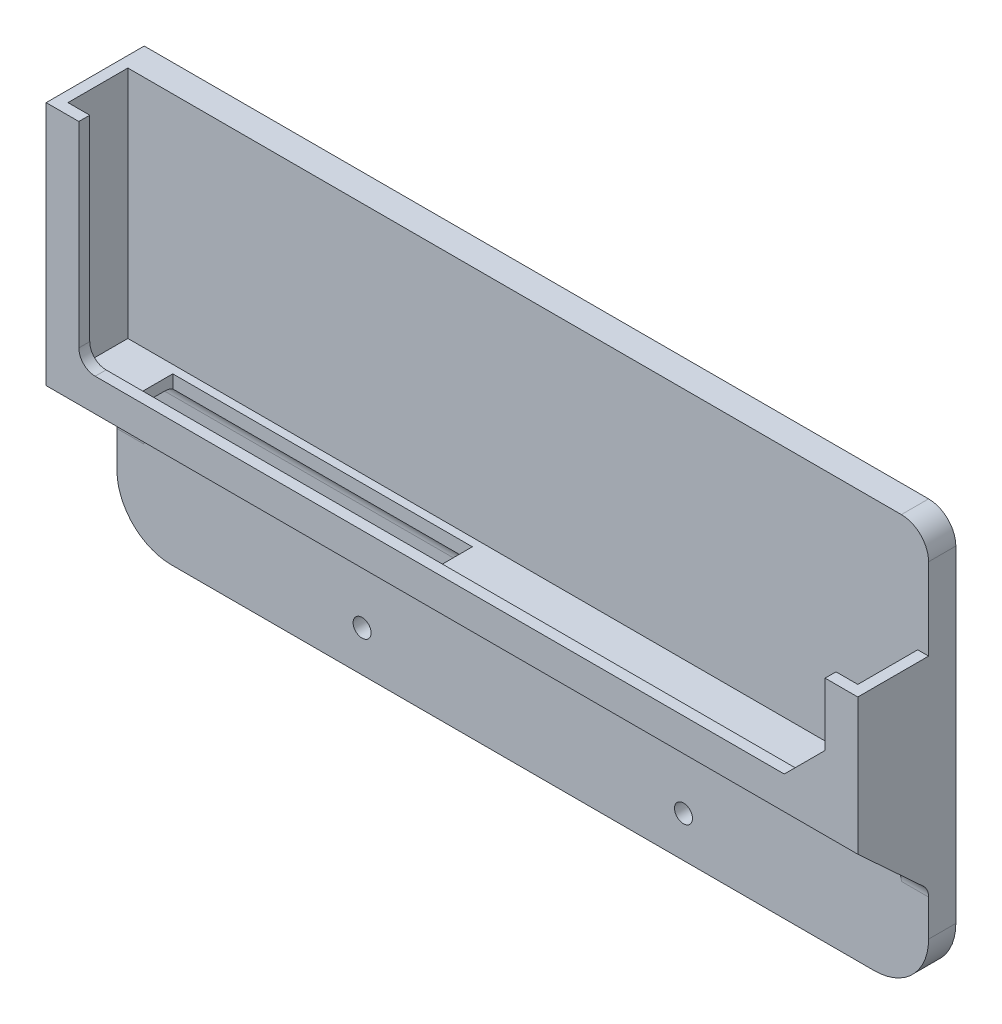
ISO-10303-21;
HEADER;
FILE_DESCRIPTION(('STEP AP214'),'2;1');
FILE_NAME('part.step','',(''),(''),'','','');
FILE_SCHEMA(('AUTOMOTIVE_DESIGN { 1 0 10303 214 1 1 1 1 }'));
ENDSEC;
DATA;
#1=APPLICATION_CONTEXT('core data for automotive mechanical design processes');
#2=APPLICATION_PROTOCOL_DEFINITION('international standard','automotive_design',2000,#1);
#3=PRODUCT_CONTEXT('',#1,'mechanical');
#4=PRODUCT('Part','Part','',(#3));
#5=PRODUCT_RELATED_PRODUCT_CATEGORY('part','',(#4));
#6=PRODUCT_DEFINITION_FORMATION('','',#4);
#7=PRODUCT_DEFINITION_CONTEXT('part definition',#1,'design');
#8=PRODUCT_DEFINITION('design','',#6,#7);
#9=PRODUCT_DEFINITION_SHAPE('','',#8);
#10=(LENGTH_UNIT() NAMED_UNIT(*) SI_UNIT(.MILLI.,.METRE.));
#11=(NAMED_UNIT(*) PLANE_ANGLE_UNIT() SI_UNIT($,.RADIAN.));
#12=(NAMED_UNIT(*) SI_UNIT($,.STERADIAN.) SOLID_ANGLE_UNIT());
#13=UNCERTAINTY_MEASURE_WITH_UNIT(LENGTH_MEASURE(1.E-05),#10,'distance_accuracy_value','');
#14=(GEOMETRIC_REPRESENTATION_CONTEXT(3) GLOBAL_UNCERTAINTY_ASSIGNED_CONTEXT((#13)) GLOBAL_UNIT_ASSIGNED_CONTEXT((#10,
#11,#12)) REPRESENTATION_CONTEXT('',''));
#15=CARTESIAN_POINT('',(0.,0.,0.));
#16=DIRECTION('',(0.,0.,1.));
#17=DIRECTION('',(1.,0.,0.));
#18=AXIS2_PLACEMENT_3D('',#15,#16,#17);
#19=CARTESIAN_POINT('',(0.,30.,16.));
#20=DIRECTION('',(0.,1.,0.));
#21=DIRECTION('',(0.,0.,1.));
#22=AXIS2_PLACEMENT_3D('',#19,#20,#21);
#23=PLANE('',#22);
#24=DIRECTION('',(0.,0.,-1.));
#25=VECTOR('',#24,1.);
#26=CARTESIAN_POINT('',(11.7410881152894,30.,16.));
#27=LINE('',#26,#25);
#28=CARTESIAN_POINT('',(11.7410881152894,30.,14.5));
#29=VERTEX_POINT('',#28);
#30=CARTESIAN_POINT('',(11.7410881152894,30.,8.));
#31=VERTEX_POINT('',#30);
#32=EDGE_CURVE('E291',#29,#31,#27,.T.);
#33=ORIENTED_EDGE('',*,*,#32,.F.);
#34=DIRECTION('',(1.,0.,0.));
#35=VECTOR('',#34,1.);
#36=CARTESIAN_POINT('',(0.,30.,14.5));
#37=LINE('',#36,#35);
#38=CARTESIAN_POINT('',(66.7410881152894,30.,14.5));
#39=VERTEX_POINT('',#38);
#40=EDGE_CURVE('E294',#29,#39,#37,.T.);
#41=ORIENTED_EDGE('',*,*,#40,.T.);
#42=DIRECTION('',(0.,0.,-1.));
#43=VECTOR('',#42,1.);
#44=CARTESIAN_POINT('',(66.7410881152894,30.,16.));
#45=LINE('',#44,#43);
#46=CARTESIAN_POINT('',(66.7410881152894,30.,8.));
#47=VERTEX_POINT('',#46);
#48=EDGE_CURVE('E283',#39,#47,#45,.T.);
#49=ORIENTED_EDGE('',*,*,#48,.T.);
#50=DIRECTION('',(1.,0.,0.));
#51=VECTOR('',#50,1.);
#52=CARTESIAN_POINT('',(0.,30.,8.));
#53=LINE('',#52,#51);
#54=CARTESIAN_POINT('',(144.,30.,8.));
#55=VERTEX_POINT('',#54);
#56=EDGE_CURVE('E526',#47,#55,#53,.T.);
#57=ORIENTED_EDGE('',*,*,#56,.T.);
#58=DIRECTION('',(0.,0.,-1.));
#59=VECTOR('',#58,1.);
#60=CARTESIAN_POINT('',(144.,30.,18.));
#61=LINE('',#60,#59);
#62=CARTESIAN_POINT('',(144.,30.,18.));
#63=VERTEX_POINT('',#62);
#64=EDGE_CURVE('E299',#63,#55,#61,.T.);
#65=ORIENTED_EDGE('',*,*,#64,.F.);
#66=DIRECTION('',(1.,0.,0.));
#67=VECTOR('',#66,1.);
#68=CARTESIAN_POINT('',(0.,30.,18.));
#69=LINE('',#68,#67);
#70=CARTESIAN_POINT('',(5.,30.,18.));
#71=VERTEX_POINT('',#70);
#72=EDGE_CURVE('E342',#71,#63,#69,.T.);
#73=ORIENTED_EDGE('',*,*,#72,.F.);
#74=DIRECTION('',(0.,0.,-1.));
#75=VECTOR('',#74,1.);
#76=CARTESIAN_POINT('',(5.,30.,18.));
#77=LINE('',#76,#75);
#78=CARTESIAN_POINT('',(5.,30.,8.));
#79=VERTEX_POINT('',#78);
#80=EDGE_CURVE('E318',#71,#79,#77,.T.);
#81=ORIENTED_EDGE('',*,*,#80,.T.);
#82=EDGE_CURVE('E527',#79,#31,#53,.T.);
#83=ORIENTED_EDGE('',*,*,#82,.T.);
#84=EDGE_LOOP('',(#33,#41,#49,#57,#65,#73,#81,#83));
#85=FACE_BOUND('',#84,.T.);
#86=ADVANCED_FACE('F41',(#85),#23,.F.);
#87=CARTESIAN_POINT('',(0.,27.,8.));
#88=DIRECTION('',(1.,0.,0.));
#89=DIRECTION('',(0.,0.,-1.));
#90=AXIS2_PLACEMENT_3D('',#87,#88,#89);
#91=CYLINDRICAL_SURFACE('',#90,3.);
#92=CARTESIAN_POINT('',(11.7410881152894,27.,8.));
#93=DIRECTION('',(1.,0.,0.));
#94=DIRECTION('',(0.,0.,-1.));
#95=AXIS2_PLACEMENT_3D('',#92,#93,#94);
#96=CIRCLE('',#95,3.);
#97=CARTESIAN_POINT('',(11.7410881152894,29.5980762113533,6.5));
#98=VERTEX_POINT('',#97);
#99=EDGE_CURVE('E573',#31,#98,#96,.F.);
#100=ORIENTED_EDGE('',*,*,#99,.F.);
#101=ORIENTED_EDGE('',*,*,#82,.F.);
#102=CARTESIAN_POINT('',(5.,27.,8.));
#103=DIRECTION('',(-1.,0.,0.));
#104=DIRECTION('',(0.,0.,1.));
#105=AXIS2_PLACEMENT_3D('',#102,#103,#104);
#106=CIRCLE('',#105,3.);
#107=CARTESIAN_POINT('',(5.,27.,5.));
#108=VERTEX_POINT('',#107);
#109=EDGE_CURVE('E545',#108,#79,#106,.F.);
#110=ORIENTED_EDGE('',*,*,#109,.F.);
#111=DIRECTION('',(1.,0.,0.));
#112=VECTOR('',#111,1.);
#113=CARTESIAN_POINT('',(0.,27.,5.));
#114=LINE('',#113,#112);
#115=CARTESIAN_POINT('',(144.,27.,5.));
#116=VERTEX_POINT('',#115);
#117=EDGE_CURVE('E542',#116,#108,#114,.F.);
#118=ORIENTED_EDGE('',*,*,#117,.F.);
#119=CARTESIAN_POINT('',(144.,27.,8.));
#120=DIRECTION('',(1.,0.,0.));
#121=DIRECTION('',(0.,0.,-1.));
#122=AXIS2_PLACEMENT_3D('',#119,#120,#121);
#123=CIRCLE('',#122,3.);
#124=EDGE_CURVE('E531',#55,#116,#123,.F.);
#125=ORIENTED_EDGE('',*,*,#124,.F.);
#126=ORIENTED_EDGE('',*,*,#56,.F.);
#127=CARTESIAN_POINT('',(66.7410881152894,27.,8.));
#128=DIRECTION('',(1.,0.,0.));
#129=DIRECTION('',(0.,0.,-1.));
#130=AXIS2_PLACEMENT_3D('',#127,#128,#129);
#131=CIRCLE('',#130,3.);
#132=CARTESIAN_POINT('',(66.7410881152894,29.5980762113533,6.5));
#133=VERTEX_POINT('',#132);
#134=EDGE_CURVE('E568',#47,#133,#131,.F.);
#135=ORIENTED_EDGE('',*,*,#134,.T.);
#136=DIRECTION('',(1.,0.,0.));
#137=VECTOR('',#136,1.);
#138=CARTESIAN_POINT('',(0.,29.5980762113533,6.5));
#139=LINE('',#138,#137);
#140=EDGE_CURVE('E253',#98,#133,#139,.T.);
#141=ORIENTED_EDGE('',*,*,#140,.F.);
#142=EDGE_LOOP('',(#100,#101,#110,#118,#125,#126,#135,#141));
#143=FACE_BOUND('',#142,.T.);
#144=ADVANCED_FACE('F704',(#143),#91,.F.);
#145=CARTESIAN_POINT('',(0.,0.,5.));
#146=DIRECTION('',(0.,0.,1.));
#147=DIRECTION('',(1.,0.,0.));
#148=AXIS2_PLACEMENT_3D('',#145,#146,#147);
#149=PLANE('',#148);
#150=DIRECTION('',(0.,-1.,0.));
#151=VECTOR('',#150,1.);
#152=CARTESIAN_POINT('',(144.,30.,5.));
#153=LINE('',#152,#151);
#154=CARTESIAN_POINT('',(144.,16.6865063047027,5.));
#155=VERTEX_POINT('',#154);
#156=EDGE_CURVE('E307',#116,#155,#153,.T.);
#157=ORIENTED_EDGE('',*,*,#156,.F.);
#158=ORIENTED_EDGE('',*,*,#117,.T.);
#159=DIRECTION('',(0.,-1.,0.));
#160=VECTOR('',#159,1.);
#161=CARTESIAN_POINT('',(5.,30.,5.));
#162=LINE('',#161,#160);
#163=CARTESIAN_POINT('',(5.,16.6865063047027,5.));
#164=VERTEX_POINT('',#163);
#165=EDGE_CURVE('E322',#108,#164,#162,.T.);
#166=ORIENTED_EDGE('',*,*,#165,.T.);
#167=DIRECTION('',(-1.,0.,0.));
#168=VECTOR('',#167,1.);
#169=CARTESIAN_POINT('',(0.,16.6865063047027,5.));
#170=LINE('',#169,#168);
#171=CARTESIAN_POINT('',(0.,16.6865063047027,5.));
#172=VERTEX_POINT('',#171);
#173=EDGE_CURVE('E534',#164,#172,#170,.T.);
#174=ORIENTED_EDGE('',*,*,#173,.T.);
#175=DIRECTION('',(0.,1.,0.));
#176=VECTOR('',#175,1.);
#177=CARTESIAN_POINT('',(0.,0.,5.));
#178=LINE('',#177,#176);
#179=CARTESIAN_POINT('',(0.,10.,5.));
#180=VERTEX_POINT('',#179);
#181=EDGE_CURVE('E437',#180,#172,#178,.T.);
#182=ORIENTED_EDGE('',*,*,#181,.F.);
#183=CARTESIAN_POINT('',(10.,10.,5.));
#184=DIRECTION('',(0.,0.,1.));
#185=DIRECTION('',(1.,0.,0.));
#186=AXIS2_PLACEMENT_3D('',#183,#184,#185);
#187=CIRCLE('',#186,10.);
#188=CARTESIAN_POINT('',(10.,0.,5.));
#189=VERTEX_POINT('',#188);
#190=EDGE_CURVE('E503',#180,#189,#187,.T.);
#191=ORIENTED_EDGE('',*,*,#190,.T.);
#192=DIRECTION('',(1.,0.,0.));
#193=VECTOR('',#192,1.);
#194=CARTESIAN_POINT('',(0.,0.,5.));
#195=LINE('',#194,#193);
#196=CARTESIAN_POINT('',(139.,0.,5.));
#197=VERTEX_POINT('',#196);
#198=EDGE_CURVE('E441',#189,#197,#195,.T.);
#199=ORIENTED_EDGE('',*,*,#198,.T.);
#200=CARTESIAN_POINT('',(139.,10.,5.));
#201=DIRECTION('',(0.,0.,1.));
#202=DIRECTION('',(1.,0.,0.));
#203=AXIS2_PLACEMENT_3D('',#200,#201,#202);
#204=CIRCLE('',#203,10.);
#205=CARTESIAN_POINT('',(149.,10.,5.));
#206=VERTEX_POINT('',#205);
#207=EDGE_CURVE('E506',#197,#206,#204,.T.);
#208=ORIENTED_EDGE('',*,*,#207,.T.);
#209=DIRECTION('',(0.,1.,0.));
#210=VECTOR('',#209,1.);
#211=CARTESIAN_POINT('',(149.,0.,5.));
#212=LINE('',#211,#210);
#213=CARTESIAN_POINT('',(149.,16.6865063047027,5.));
#214=VERTEX_POINT('',#213);
#215=EDGE_CURVE('E447',#206,#214,#212,.T.);
#216=ORIENTED_EDGE('',*,*,#215,.T.);
#217=DIRECTION('',(1.,0.,0.));
#218=VECTOR('',#217,1.);
#219=CARTESIAN_POINT('',(144.,16.6865063047027,5.));
#220=LINE('',#219,#218);
#221=EDGE_CURVE('E538',#214,#155,#220,.F.);
#222=ORIENTED_EDGE('',*,*,#221,.T.);
#223=EDGE_LOOP('',(#157,#158,#166,#174,#182,#191,#199,#208,#216,#222));
#224=FACE_BOUND('',#223,.T.);
#225=CARTESIAN_POINT('',(104.,7.5,5.));
#226=DIRECTION('',(0.,0.,1.));
#227=DIRECTION('',(1.,0.,0.));
#228=AXIS2_PLACEMENT_3D('',#225,#226,#227);
#229=CIRCLE('',#228,1.64999999999999);
#230=CARTESIAN_POINT('',(105.65,7.5,5.));
#231=VERTEX_POINT('',#230);
#232=EDGE_CURVE('E455',#231,#231,#229,.T.);
#233=ORIENTED_EDGE('',*,*,#232,.F.);
#234=EDGE_LOOP('',(#233));
#235=FACE_BOUND('',#234,.T.);
#236=CARTESIAN_POINT('',(45.,7.5,5.));
#237=DIRECTION('',(0.,0.,1.));
#238=DIRECTION('',(1.,0.,0.));
#239=AXIS2_PLACEMENT_3D('',#236,#237,#238);
#240=CIRCLE('',#239,1.65);
#241=CARTESIAN_POINT('',(46.65,7.5,5.));
#242=VERTEX_POINT('',#241);
#243=EDGE_CURVE('E459',#242,#242,#240,.T.);
#244=ORIENTED_EDGE('',*,*,#243,.F.);
#245=EDGE_LOOP('',(#244));
#246=FACE_BOUND('',#245,.T.);
#247=ADVANCED_FACE('F624',(#224,#235,#246),#149,.T.);
#248=CARTESIAN_POINT('',(149.,55.,5.));
#249=VERTEX_POINT('',#248);
#250=CARTESIAN_POINT('',(149.,70.,5.));
#251=VERTEX_POINT('',#250);
#252=EDGE_CURVE('E446',#249,#251,#212,.T.);
#253=ORIENTED_EDGE('',*,*,#252,.T.);
#254=CARTESIAN_POINT('',(144.,70.,5.));
#255=DIRECTION('',(0.,0.,1.));
#256=DIRECTION('',(1.,0.,0.));
#257=AXIS2_PLACEMENT_3D('',#254,#255,#256);
#258=CIRCLE('',#257,5.);
#259=CARTESIAN_POINT('',(144.,75.,5.));
#260=VERTEX_POINT('',#259);
#261=EDGE_CURVE('E11',#251,#260,#258,.T.);
#262=ORIENTED_EDGE('',*,*,#261,.T.);
#263=DIRECTION('',(1.,0.,0.));
#264=VECTOR('',#263,1.);
#265=CARTESIAN_POINT('',(0.,75.,5.));
#266=LINE('',#265,#264);
#267=CARTESIAN_POINT('',(2.,75.,5.));
#268=VERTEX_POINT('',#267);
#269=EDGE_CURVE('E451',#268,#260,#266,.T.);
#270=ORIENTED_EDGE('',*,*,#269,.F.);
#271=DIRECTION('',(0.,1.,0.));
#272=VECTOR('',#271,1.);
#273=CARTESIAN_POINT('',(2.,73.,5.));
#274=LINE('',#273,#272);
#275=CARTESIAN_POINT('',(2.00000000000001,32.,5.));
#276=VERTEX_POINT('',#275);
#277=EDGE_CURVE('E394',#276,#268,#274,.T.);
#278=ORIENTED_EDGE('',*,*,#277,.F.);
#279=DIRECTION('',(-1.,0.,0.));
#280=VECTOR('',#279,1.);
#281=CARTESIAN_POINT('',(2.00000000000001,32.,5.));
#282=LINE('',#281,#280);
#283=CARTESIAN_POINT('',(147.,32.,5.));
#284=VERTEX_POINT('',#283);
#285=EDGE_CURVE('E410',#284,#276,#282,.T.);
#286=ORIENTED_EDGE('',*,*,#285,.F.);
#287=DIRECTION('',(0.,-1.,0.));
#288=VECTOR('',#287,1.);
#289=CARTESIAN_POINT('',(147.,55.,5.));
#290=LINE('',#289,#288);
#291=CARTESIAN_POINT('',(147.,55.,5.));
#292=VERTEX_POINT('',#291);
#293=EDGE_CURVE('E406',#292,#284,#290,.T.);
#294=ORIENTED_EDGE('',*,*,#293,.F.);
#295=DIRECTION('',(-1.,0.,0.));
#296=VECTOR('',#295,1.);
#297=CARTESIAN_POINT('',(149.,55.,5.));
#298=LINE('',#297,#296);
#299=EDGE_CURVE('E388',#249,#292,#298,.T.);
#300=ORIENTED_EDGE('',*,*,#299,.F.);
#301=EDGE_LOOP('',(#253,#262,#270,#278,#286,#294,#300));
#302=FACE_BOUND('',#301,.T.);
#303=ADVANCED_FACE('F655',(#302),#149,.T.);
#304=CARTESIAN_POINT('',(0.,0.,5.));
#305=DIRECTION('',(-1.,0.,0.));
#306=DIRECTION('',(0.,0.,1.));
#307=AXIS2_PLACEMENT_3D('',#304,#305,#306);
#308=PLANE('',#307);
#309=ORIENTED_EDGE('',*,*,#181,.T.);
#310=CARTESIAN_POINT('',(0.,16.6865063047027,8.));
#311=DIRECTION('',(-1.,0.,0.));
#312=DIRECTION('',(0.,0.,1.));
#313=AXIS2_PLACEMENT_3D('',#310,#311,#312);
#314=CIRCLE('',#313,3.);
#315=CARTESIAN_POINT('',(0.,18.8909166385851,5.96515969180078));
#316=VERTEX_POINT('',#315);
#317=EDGE_CURVE('E561',#172,#316,#314,.F.);
#318=ORIENTED_EDGE('',*,*,#317,.T.);
#319=DIRECTION('',(0.,-0.678280102733072,-0.734803444627482));
#320=VECTOR('',#319,1.);
#321=CARTESIAN_POINT('',(0.,30.,18.));
#322=LINE('',#321,#320);
#323=CARTESIAN_POINT('',(0.,30.,18.));
#324=VERTEX_POINT('',#323);
#325=EDGE_CURVE('E317',#324,#316,#322,.T.);
#326=ORIENTED_EDGE('',*,*,#325,.F.);
#327=DIRECTION('',(0.,-1.,0.));
#328=VECTOR('',#327,1.);
#329=CARTESIAN_POINT('',(0.,75.,18.));
#330=LINE('',#329,#328);
#331=CARTESIAN_POINT('',(0.,75.,18.));
#332=VERTEX_POINT('',#331);
#333=EDGE_CURVE('E337',#332,#324,#330,.T.);
#334=ORIENTED_EDGE('',*,*,#333,.F.);
#335=DIRECTION('',(0.,0.,-1.));
#336=VECTOR('',#335,1.);
#337=CARTESIAN_POINT('',(0.,75.,5.));
#338=LINE('',#337,#336);
#339=CARTESIAN_POINT('',(0.,75.,0.));
#340=VERTEX_POINT('',#339);
#341=EDGE_CURVE('E463',#332,#340,#338,.T.);
#342=ORIENTED_EDGE('',*,*,#341,.T.);
#343=DIRECTION('',(0.,1.,0.));
#344=VECTOR('',#343,1.);
#345=CARTESIAN_POINT('',(0.,0.,0.));
#346=LINE('',#345,#344);
#347=CARTESIAN_POINT('',(0.,10.,0.));
#348=VERTEX_POINT('',#347);
#349=EDGE_CURVE('E436',#348,#340,#346,.T.);
#350=ORIENTED_EDGE('',*,*,#349,.F.);
#351=DIRECTION('',(0.,0.,-1.));
#352=VECTOR('',#351,1.);
#353=CARTESIAN_POINT('',(0.,10.,5.));
#354=LINE('',#353,#352);
#355=EDGE_CURVE('E509',#348,#180,#354,.F.);
#356=ORIENTED_EDGE('',*,*,#355,.T.);
#357=EDGE_LOOP('',(#309,#318,#326,#334,#342,#350,#356));
#358=FACE_BOUND('',#357,.T.);
#359=ADVANCED_FACE('F643',(#358),#308,.T.);
#360=CARTESIAN_POINT('',(0.,0.,5.));
#361=DIRECTION('',(0.,1.,0.));
#362=DIRECTION('',(0.,0.,1.));
#363=AXIS2_PLACEMENT_3D('',#360,#361,#362);
#364=PLANE('',#363);
#365=DIRECTION('',(1.,0.,0.));
#366=VECTOR('',#365,1.);
#367=CARTESIAN_POINT('',(0.,0.,0.));
#368=LINE('',#367,#366);
#369=CARTESIAN_POINT('',(10.,0.,0.));
#370=VERTEX_POINT('',#369);
#371=CARTESIAN_POINT('',(139.,0.,0.));
#372=VERTEX_POINT('',#371);
#373=EDGE_CURVE('E466',#370,#372,#368,.T.);
#374=ORIENTED_EDGE('',*,*,#373,.T.);
#375=DIRECTION('',(0.,0.,-1.));
#376=VECTOR('',#375,1.);
#377=CARTESIAN_POINT('',(139.,0.,5.));
#378=LINE('',#377,#376);
#379=EDGE_CURVE('E500',#372,#197,#378,.F.);
#380=ORIENTED_EDGE('',*,*,#379,.T.);
#381=ORIENTED_EDGE('',*,*,#198,.F.);
#382=DIRECTION('',(0.,0.,-1.));
#383=VECTOR('',#382,1.);
#384=CARTESIAN_POINT('',(10.,0.,0.));
#385=LINE('',#384,#383);
#386=EDGE_CURVE('E496',#189,#370,#385,.T.);
#387=ORIENTED_EDGE('',*,*,#386,.T.);
#388=EDGE_LOOP('',(#374,#380,#381,#387));
#389=FACE_BOUND('',#388,.T.);
#390=ADVANCED_FACE('F635',(#389),#364,.F.);
#391=CARTESIAN_POINT('',(149.,0.,5.));
#392=DIRECTION('',(-1.,0.,0.));
#393=DIRECTION('',(0.,0.,1.));
#394=AXIS2_PLACEMENT_3D('',#391,#392,#393);
#395=PLANE('',#394);
#396=DIRECTION('',(0.,1.,0.));
#397=VECTOR('',#396,1.);
#398=CARTESIAN_POINT('',(149.,0.,0.));
#399=LINE('',#398,#397);
#400=CARTESIAN_POINT('',(149.,10.,0.));
#401=VERTEX_POINT('',#400);
#402=CARTESIAN_POINT('',(149.,70.,0.));
#403=VERTEX_POINT('',#402);
#404=EDGE_CURVE('E470',#401,#403,#399,.T.);
#405=ORIENTED_EDGE('',*,*,#404,.T.);
#406=DIRECTION('',(0.,0.,-1.));
#407=VECTOR('',#406,1.);
#408=CARTESIAN_POINT('',(149.,70.,5.));
#409=LINE('',#408,#407);
#410=EDGE_CURVE('E50',#403,#251,#409,.F.);
#411=ORIENTED_EDGE('',*,*,#410,.T.);
#412=ORIENTED_EDGE('',*,*,#252,.F.);
#413=DIRECTION('',(0.,0.,-1.));
#414=VECTOR('',#413,1.);
#415=CARTESIAN_POINT('',(149.,55.,16.));
#416=LINE('',#415,#414);
#417=CARTESIAN_POINT('',(149.,55.,18.));
#418=VERTEX_POINT('',#417);
#419=EDGE_CURVE('E432',#418,#249,#416,.T.);
#420=ORIENTED_EDGE('',*,*,#419,.F.);
#421=DIRECTION('',(0.,1.,0.));
#422=VECTOR('',#421,1.);
#423=CARTESIAN_POINT('',(149.,30.,18.));
#424=LINE('',#423,#422);
#425=CARTESIAN_POINT('',(149.,30.,18.));
#426=VERTEX_POINT('',#425);
#427=EDGE_CURVE('E347',#426,#418,#424,.T.);
#428=ORIENTED_EDGE('',*,*,#427,.F.);
#429=DIRECTION('',(0.,-0.678280102733072,-0.734803444627482));
#430=VECTOR('',#429,1.);
#431=CARTESIAN_POINT('',(149.,30.,18.));
#432=LINE('',#431,#430);
#433=CARTESIAN_POINT('',(149.,18.8909166385851,5.96515969180078));
#434=VERTEX_POINT('',#433);
#435=EDGE_CURVE('E298',#426,#434,#432,.T.);
#436=ORIENTED_EDGE('',*,*,#435,.T.);
#437=CARTESIAN_POINT('',(149.,16.6865063047027,8.));
#438=DIRECTION('',(-1.,0.,0.));
#439=DIRECTION('',(0.,0.,1.));
#440=AXIS2_PLACEMENT_3D('',#437,#438,#439);
#441=CIRCLE('',#440,3.);
#442=EDGE_CURVE('E555',#434,#214,#441,.T.);
#443=ORIENTED_EDGE('',*,*,#442,.T.);
#444=ORIENTED_EDGE('',*,*,#215,.F.);
#445=DIRECTION('',(0.,0.,-1.));
#446=VECTOR('',#445,1.);
#447=CARTESIAN_POINT('',(149.,10.,5.));
#448=LINE('',#447,#446);
#449=EDGE_CURVE('E486',#206,#401,#448,.T.);
#450=ORIENTED_EDGE('',*,*,#449,.T.);
#451=EDGE_LOOP('',(#405,#411,#412,#420,#428,#436,#443,#444,#450));
#452=FACE_BOUND('',#451,.T.);
#453=ADVANCED_FACE('F621',(#452),#395,.F.);
#454=CARTESIAN_POINT('',(104.,7.5,5.));
#455=DIRECTION('',(0.,0.,-1.));
#456=DIRECTION('',(-1.,0.,0.));
#457=AXIS2_PLACEMENT_3D('',#454,#455,#456);
#458=CYLINDRICAL_SURFACE('',#457,1.64999999999999);
#459=ORIENTED_EDGE('',*,*,#232,.T.);
#460=EDGE_LOOP('',(#459));
#461=FACE_BOUND('',#460,.T.);
#462=CARTESIAN_POINT('',(104.,7.5,0.));
#463=DIRECTION('',(0.,0.,1.));
#464=DIRECTION('',(1.,0.,0.));
#465=AXIS2_PLACEMENT_3D('',#462,#463,#464);
#466=CIRCLE('',#465,1.64999999999999);
#467=CARTESIAN_POINT('',(105.65,7.5,0.));
#468=VERTEX_POINT('',#467);
#469=EDGE_CURVE('E476',#468,#468,#466,.T.);
#470=ORIENTED_EDGE('',*,*,#469,.F.);
#471=EDGE_LOOP('',(#470));
#472=FACE_BOUND('',#471,.T.);
#473=ADVANCED_FACE('F722',(#461,#472),#458,.F.);
#474=CARTESIAN_POINT('',(0.,75.,5.));
#475=DIRECTION('',(0.,1.,0.));
#476=DIRECTION('',(0.,0.,1.));
#477=AXIS2_PLACEMENT_3D('',#474,#475,#476);
#478=PLANE('',#477);
#479=ORIENTED_EDGE('',*,*,#269,.T.);
#480=DIRECTION('',(0.,0.,-1.));
#481=VECTOR('',#480,1.);
#482=CARTESIAN_POINT('',(144.,75.,0.));
#483=LINE('',#482,#481);
#484=CARTESIAN_POINT('',(144.,75.,0.));
#485=VERTEX_POINT('',#484);
#486=EDGE_CURVE('E589',#260,#485,#483,.T.);
#487=ORIENTED_EDGE('',*,*,#486,.T.);
#488=DIRECTION('',(1.,0.,0.));
#489=VECTOR('',#488,1.);
#490=CARTESIAN_POINT('',(0.,75.,0.));
#491=LINE('',#490,#489);
#492=EDGE_CURVE('E473',#340,#485,#491,.T.);
#493=ORIENTED_EDGE('',*,*,#492,.F.);
#494=ORIENTED_EDGE('',*,*,#341,.F.);
#495=DIRECTION('',(-1.,0.,0.));
#496=VECTOR('',#495,1.);
#497=CARTESIAN_POINT('',(6.,75.,18.));
#498=LINE('',#497,#496);
#499=CARTESIAN_POINT('',(6.,75.,18.));
#500=VERTEX_POINT('',#499);
#501=EDGE_CURVE('E333',#500,#332,#498,.T.);
#502=ORIENTED_EDGE('',*,*,#501,.F.);
#503=DIRECTION('',(0.,0.,-1.));
#504=VECTOR('',#503,1.);
#505=CARTESIAN_POINT('',(6.,75.,18.));
#506=LINE('',#505,#504);
#507=CARTESIAN_POINT('',(6.,75.,16.));
#508=VERTEX_POINT('',#507);
#509=EDGE_CURVE('E365',#500,#508,#506,.T.);
#510=ORIENTED_EDGE('',*,*,#509,.T.);
#511=DIRECTION('',(-1.,0.,0.));
#512=VECTOR('',#511,1.);
#513=CARTESIAN_POINT('',(6.,75.,16.));
#514=LINE('',#513,#512);
#515=CARTESIAN_POINT('',(2.00000000000001,75.,16.));
#516=VERTEX_POINT('',#515);
#517=EDGE_CURVE('E329',#508,#516,#514,.T.);
#518=ORIENTED_EDGE('',*,*,#517,.T.);
#519=DIRECTION('',(0.,0.,-1.));
#520=VECTOR('',#519,1.);
#521=CARTESIAN_POINT('',(2.,75.,16.));
#522=LINE('',#521,#520);
#523=EDGE_CURVE('E402',#516,#268,#522,.T.);
#524=ORIENTED_EDGE('',*,*,#523,.T.);
#525=EDGE_LOOP('',(#479,#487,#493,#494,#502,#510,#518,#524));
#526=FACE_BOUND('',#525,.T.);
#527=ADVANCED_FACE('F650',(#526),#478,.T.);
#528=CARTESIAN_POINT('',(45.,7.5,5.));
#529=DIRECTION('',(0.,0.,-1.));
#530=DIRECTION('',(-1.,0.,0.));
#531=AXIS2_PLACEMENT_3D('',#528,#529,#530);
#532=CYLINDRICAL_SURFACE('',#531,1.65);
#533=ORIENTED_EDGE('',*,*,#243,.T.);
#534=EDGE_LOOP('',(#533));
#535=FACE_BOUND('',#534,.T.);
#536=CARTESIAN_POINT('',(45.,7.5,0.));
#537=DIRECTION('',(0.,0.,1.));
#538=DIRECTION('',(1.,0.,0.));
#539=AXIS2_PLACEMENT_3D('',#536,#537,#538);
#540=CIRCLE('',#539,1.65);
#541=CARTESIAN_POINT('',(46.65,7.5,0.));
#542=VERTEX_POINT('',#541);
#543=EDGE_CURVE('E442',#542,#542,#540,.T.);
#544=ORIENTED_EDGE('',*,*,#543,.F.);
#545=EDGE_LOOP('',(#544));
#546=FACE_BOUND('',#545,.T.);
#547=ADVANCED_FACE('F718',(#535,#546),#532,.F.);
#548=CARTESIAN_POINT('',(0.,0.,0.));
#549=DIRECTION('',(0.,0.,1.));
#550=DIRECTION('',(1.,0.,0.));
#551=AXIS2_PLACEMENT_3D('',#548,#549,#550);
#552=PLANE('',#551);
#553=ORIENTED_EDGE('',*,*,#492,.T.);
#554=CARTESIAN_POINT('',(144.,70.,0.));
#555=DIRECTION('',(0.,0.,1.));
#556=DIRECTION('',(1.,0.,0.));
#557=AXIS2_PLACEMENT_3D('',#554,#555,#556);
#558=CIRCLE('',#557,5.);
#559=EDGE_CURVE('E64',#485,#403,#558,.F.);
#560=ORIENTED_EDGE('',*,*,#559,.T.);
#561=ORIENTED_EDGE('',*,*,#404,.F.);
#562=CARTESIAN_POINT('',(139.,10.,0.));
#563=DIRECTION('',(0.,0.,1.));
#564=DIRECTION('',(1.,0.,0.));
#565=AXIS2_PLACEMENT_3D('',#562,#563,#564);
#566=CIRCLE('',#565,10.);
#567=EDGE_CURVE('E493',#401,#372,#566,.F.);
#568=ORIENTED_EDGE('',*,*,#567,.T.);
#569=ORIENTED_EDGE('',*,*,#373,.F.);
#570=CARTESIAN_POINT('',(10.,10.,0.));
#571=DIRECTION('',(0.,0.,1.));
#572=DIRECTION('',(1.,0.,0.));
#573=AXIS2_PLACEMENT_3D('',#570,#571,#572);
#574=CIRCLE('',#573,10.);
#575=EDGE_CURVE('E490',#370,#348,#574,.F.);
#576=ORIENTED_EDGE('',*,*,#575,.T.);
#577=ORIENTED_EDGE('',*,*,#349,.T.);
#578=EDGE_LOOP('',(#553,#560,#561,#568,#569,#576,#577));
#579=FACE_BOUND('',#578,.T.);
#580=ORIENTED_EDGE('',*,*,#469,.T.);
#581=EDGE_LOOP('',(#580));
#582=FACE_BOUND('',#581,.T.);
#583=ORIENTED_EDGE('',*,*,#543,.T.);
#584=EDGE_LOOP('',(#583));
#585=FACE_BOUND('',#584,.T.);
#586=ADVANCED_FACE('F631',(#579,#582,#585),#552,.F.);
#587=CARTESIAN_POINT('',(139.,10.,5.));
#588=DIRECTION('',(0.,0.,-1.));
#589=DIRECTION('',(-1.,0.,0.));
#590=AXIS2_PLACEMENT_3D('',#587,#588,#589);
#591=CYLINDRICAL_SURFACE('',#590,10.);
#592=ORIENTED_EDGE('',*,*,#207,.F.);
#593=ORIENTED_EDGE('',*,*,#379,.F.);
#594=ORIENTED_EDGE('',*,*,#567,.F.);
#595=ORIENTED_EDGE('',*,*,#449,.F.);
#596=EDGE_LOOP('',(#592,#593,#594,#595));
#597=FACE_BOUND('',#596,.T.);
#598=ADVANCED_FACE('F630',(#597),#591,.T.);
#599=CARTESIAN_POINT('',(10.,10.,5.));
#600=DIRECTION('',(0.,0.,1.));
#601=DIRECTION('',(1.,0.,0.));
#602=AXIS2_PLACEMENT_3D('',#599,#600,#601);
#603=CYLINDRICAL_SURFACE('',#602,10.);
#604=ORIENTED_EDGE('',*,*,#190,.F.);
#605=ORIENTED_EDGE('',*,*,#355,.F.);
#606=ORIENTED_EDGE('',*,*,#575,.F.);
#607=ORIENTED_EDGE('',*,*,#386,.F.);
#608=EDGE_LOOP('',(#604,#605,#606,#607));
#609=FACE_BOUND('',#608,.T.);
#610=ADVANCED_FACE('F639',(#609),#603,.T.);
#611=CARTESIAN_POINT('',(149.,55.,16.));
#612=DIRECTION('',(0.,-1.,0.));
#613=DIRECTION('',(0.,0.,-1.));
#614=AXIS2_PLACEMENT_3D('',#611,#612,#613);
#615=PLANE('',#614);
#616=ORIENTED_EDGE('',*,*,#299,.T.);
#617=DIRECTION('',(0.,0.,-1.));
#618=VECTOR('',#617,1.);
#619=CARTESIAN_POINT('',(147.,55.,16.));
#620=LINE('',#619,#618);
#621=CARTESIAN_POINT('',(147.,55.,16.));
#622=VERTEX_POINT('',#621);
#623=EDGE_CURVE('E428',#622,#292,#620,.T.);
#624=ORIENTED_EDGE('',*,*,#623,.F.);
#625=DIRECTION('',(1.,0.,0.));
#626=VECTOR('',#625,1.);
#627=CARTESIAN_POINT('',(143.,55.,16.));
#628=LINE('',#627,#626);
#629=CARTESIAN_POINT('',(143.,55.,16.));
#630=VERTEX_POINT('',#629);
#631=EDGE_CURVE('E369',#630,#622,#628,.T.);
#632=ORIENTED_EDGE('',*,*,#631,.F.);
#633=DIRECTION('',(0.,0.,-1.));
#634=VECTOR('',#633,1.);
#635=CARTESIAN_POINT('',(143.,55.,18.));
#636=LINE('',#635,#634);
#637=CARTESIAN_POINT('',(143.,55.,18.));
#638=VERTEX_POINT('',#637);
#639=EDGE_CURVE('E384',#638,#630,#636,.T.);
#640=ORIENTED_EDGE('',*,*,#639,.F.);
#641=DIRECTION('',(1.,0.,0.));
#642=VECTOR('',#641,1.);
#643=CARTESIAN_POINT('',(143.,55.,18.));
#644=LINE('',#643,#642);
#645=EDGE_CURVE('E351',#638,#418,#644,.T.);
#646=ORIENTED_EDGE('',*,*,#645,.T.);
#647=ORIENTED_EDGE('',*,*,#419,.T.);
#648=EDGE_LOOP('',(#616,#624,#632,#640,#646,#647));
#649=FACE_BOUND('',#648,.T.);
#650=ADVANCED_FACE('F657',(#649),#615,.F.);
#651=CARTESIAN_POINT('',(147.,55.,16.));
#652=DIRECTION('',(1.,0.,0.));
#653=DIRECTION('',(0.,0.,-1.));
#654=AXIS2_PLACEMENT_3D('',#651,#652,#653);
#655=PLANE('',#654);
#656=ORIENTED_EDGE('',*,*,#293,.T.);
#657=DIRECTION('',(0.,0.,-1.));
#658=VECTOR('',#657,1.);
#659=CARTESIAN_POINT('',(147.,32.,16.));
#660=LINE('',#659,#658);
#661=CARTESIAN_POINT('',(147.,32.,16.));
#662=VERTEX_POINT('',#661);
#663=EDGE_CURVE('E424',#662,#284,#660,.T.);
#664=ORIENTED_EDGE('',*,*,#663,.F.);
#665=DIRECTION('',(0.,-1.,0.));
#666=VECTOR('',#665,1.);
#667=CARTESIAN_POINT('',(147.,55.,16.));
#668=LINE('',#667,#666);
#669=EDGE_CURVE('E389',#622,#662,#668,.T.);
#670=ORIENTED_EDGE('',*,*,#669,.F.);
#671=ORIENTED_EDGE('',*,*,#623,.T.);
#672=EDGE_LOOP('',(#656,#664,#670,#671));
#673=FACE_BOUND('',#672,.T.);
#674=ADVANCED_FACE('F691',(#673),#655,.F.);
#675=CARTESIAN_POINT('',(2.00000000000001,32.,16.));
#676=DIRECTION('',(0.,-1.,0.));
#677=DIRECTION('',(0.,0.,-1.));
#678=AXIS2_PLACEMENT_3D('',#675,#676,#677);
#679=PLANE('',#678);
#680=DIRECTION('',(0.,0.,-1.));
#681=VECTOR('',#680,1.);
#682=CARTESIAN_POINT('',(66.7410881152894,32.,0.));
#683=LINE('',#682,#681);
#684=CARTESIAN_POINT('',(66.7410881152894,32.,14.5));
#685=VERTEX_POINT('',#684);
#686=CARTESIAN_POINT('',(66.7410881152894,32.,6.5));
#687=VERTEX_POINT('',#686);
#688=EDGE_CURVE('E262',#685,#687,#683,.T.);
#689=ORIENTED_EDGE('',*,*,#688,.F.);
#690=DIRECTION('',(1.,0.,0.));
#691=VECTOR('',#690,1.);
#692=CARTESIAN_POINT('',(0.,32.,14.5));
#693=LINE('',#692,#691);
#694=CARTESIAN_POINT('',(11.7410881152894,32.,14.5));
#695=VERTEX_POINT('',#694);
#696=EDGE_CURVE('E268',#695,#685,#693,.T.);
#697=ORIENTED_EDGE('',*,*,#696,.F.);
#698=DIRECTION('',(0.,0.,-1.));
#699=VECTOR('',#698,1.);
#700=CARTESIAN_POINT('',(11.7410881152894,32.,0.));
#701=LINE('',#700,#699);
#702=CARTESIAN_POINT('',(11.7410881152894,32.,6.5));
#703=VERTEX_POINT('',#702);
#704=EDGE_CURVE('E273',#695,#703,#701,.T.);
#705=ORIENTED_EDGE('',*,*,#704,.T.);
#706=DIRECTION('',(1.,0.,0.));
#707=VECTOR('',#706,1.);
#708=CARTESIAN_POINT('',(0.,32.,6.5));
#709=LINE('',#708,#707);
#710=EDGE_CURVE('E250',#703,#687,#709,.T.);
#711=ORIENTED_EDGE('',*,*,#710,.T.);
#712=EDGE_LOOP('',(#689,#697,#705,#711));
#713=FACE_BOUND('',#712,.T.);
#714=ORIENTED_EDGE('',*,*,#285,.T.);
#715=DIRECTION('',(0.,0.,-1.));
#716=VECTOR('',#715,1.);
#717=CARTESIAN_POINT('',(2.00000000000001,32.,16.));
#718=LINE('',#717,#716);
#719=CARTESIAN_POINT('',(2.00000000000001,32.,16.));
#720=VERTEX_POINT('',#719);
#721=EDGE_CURVE('E420',#720,#276,#718,.T.);
#722=ORIENTED_EDGE('',*,*,#721,.F.);
#723=DIRECTION('',(-1.,0.,0.));
#724=VECTOR('',#723,1.);
#725=CARTESIAN_POINT('',(2.00000000000001,32.,16.));
#726=LINE('',#725,#724);
#727=EDGE_CURVE('E393',#662,#720,#726,.T.);
#728=ORIENTED_EDGE('',*,*,#727,.F.);
#729=ORIENTED_EDGE('',*,*,#663,.T.);
#730=EDGE_LOOP('',(#714,#722,#728,#729));
#731=FACE_BOUND('',#730,.T.);
#732=ADVANCED_FACE('F270',(#713,#731),#679,.F.);
#733=CARTESIAN_POINT('',(2.,73.,16.));
#734=DIRECTION('',(-1.,0.,0.));
#735=DIRECTION('',(0.,-1.,0.));
#736=AXIS2_PLACEMENT_3D('',#733,#734,#735);
#737=PLANE('',#736);
#738=ORIENTED_EDGE('',*,*,#277,.T.);
#739=ORIENTED_EDGE('',*,*,#523,.F.);
#740=DIRECTION('',(0.,1.,0.));
#741=VECTOR('',#740,1.);
#742=CARTESIAN_POINT('',(2.,73.,16.));
#743=LINE('',#742,#741);
#744=EDGE_CURVE('E398',#720,#516,#743,.T.);
#745=ORIENTED_EDGE('',*,*,#744,.F.);
#746=ORIENTED_EDGE('',*,*,#721,.T.);
#747=EDGE_LOOP('',(#738,#739,#745,#746));
#748=FACE_BOUND('',#747,.T.);
#749=ADVANCED_FACE('F687',(#748),#737,.F.);
#750=CARTESIAN_POINT('',(0.,0.,16.));
#751=DIRECTION('',(0.,0.,1.));
#752=DIRECTION('',(1.,0.,0.));
#753=AXIS2_PLACEMENT_3D('',#750,#751,#752);
#754=PLANE('',#753);
#755=ORIENTED_EDGE('',*,*,#631,.T.);
#756=ORIENTED_EDGE('',*,*,#669,.T.);
#757=ORIENTED_EDGE('',*,*,#727,.T.);
#758=ORIENTED_EDGE('',*,*,#744,.T.);
#759=ORIENTED_EDGE('',*,*,#517,.F.);
#760=DIRECTION('',(0.,-1.,0.));
#761=VECTOR('',#760,1.);
#762=CARTESIAN_POINT('',(6.,75.,16.));
#763=LINE('',#762,#761);
#764=CARTESIAN_POINT('',(6.00000000000001,39.,16.));
#765=VERTEX_POINT('',#764);
#766=EDGE_CURVE('E338',#508,#765,#763,.T.);
#767=ORIENTED_EDGE('',*,*,#766,.T.);
#768=CARTESIAN_POINT('',(9.00000000000001,39.,16.));
#769=DIRECTION('',(0.,0.,1.));
#770=DIRECTION('',(1.,0.,0.));
#771=AXIS2_PLACEMENT_3D('',#768,#769,#770);
#772=CIRCLE('',#771,3.);
#773=CARTESIAN_POINT('',(9.00000000000001,36.,16.));
#774=VERTEX_POINT('',#773);
#775=EDGE_CURVE('E583',#765,#774,#772,.T.);
#776=ORIENTED_EDGE('',*,*,#775,.T.);
#777=DIRECTION('',(1.,0.,0.));
#778=VECTOR('',#777,1.);
#779=CARTESIAN_POINT('',(6.00000000000001,36.,16.));
#780=LINE('',#779,#778);
#781=CARTESIAN_POINT('',(135.5,36.,16.));
#782=VERTEX_POINT('',#781);
#783=EDGE_CURVE('E376',#774,#782,#780,.T.);
#784=ORIENTED_EDGE('',*,*,#783,.T.);
#785=DIRECTION('',(-0.707106781186553,-0.707106781186542,0.));
#786=VECTOR('',#785,1.);
#787=CARTESIAN_POINT('',(49.7499999999989,-49.7499999999997,16.));
#788=LINE('',#787,#786);
#789=CARTESIAN_POINT('',(143.,43.5,16.));
#790=VERTEX_POINT('',#789);
#791=EDGE_CURVE('E519',#782,#790,#788,.F.);
#792=ORIENTED_EDGE('',*,*,#791,.T.);
#793=DIRECTION('',(0.,1.,0.));
#794=VECTOR('',#793,1.);
#795=CARTESIAN_POINT('',(143.,36.,16.));
#796=LINE('',#795,#794);
#797=EDGE_CURVE('E373',#790,#630,#796,.T.);
#798=ORIENTED_EDGE('',*,*,#797,.T.);
#799=EDGE_LOOP('',(#755,#756,#757,#758,#759,#767,#776,#784,#792,#798));
#800=FACE_BOUND('',#799,.T.);
#801=ADVANCED_FACE('F684',(#800),#754,.F.);
#802=CARTESIAN_POINT('',(143.,36.,18.));
#803=DIRECTION('',(-1.,0.,0.));
#804=DIRECTION('',(0.,0.,1.));
#805=AXIS2_PLACEMENT_3D('',#802,#803,#804);
#806=PLANE('',#805);
#807=ORIENTED_EDGE('',*,*,#797,.F.);
#808=DIRECTION('',(0.,0.,1.));
#809=VECTOR('',#808,1.);
#810=CARTESIAN_POINT('',(143.,43.5,18.));
#811=LINE('',#810,#809);
#812=CARTESIAN_POINT('',(143.,43.5,18.));
#813=VERTEX_POINT('',#812);
#814=EDGE_CURVE('E516',#790,#813,#811,.T.);
#815=ORIENTED_EDGE('',*,*,#814,.T.);
#816=DIRECTION('',(0.,1.,0.));
#817=VECTOR('',#816,1.);
#818=CARTESIAN_POINT('',(143.,36.,18.));
#819=LINE('',#818,#817);
#820=EDGE_CURVE('E355',#813,#638,#819,.T.);
#821=ORIENTED_EDGE('',*,*,#820,.T.);
#822=ORIENTED_EDGE('',*,*,#639,.T.);
#823=EDGE_LOOP('',(#807,#815,#821,#822));
#824=FACE_BOUND('',#823,.T.);
#825=ADVANCED_FACE('F693',(#824),#806,.T.);
#826=CARTESIAN_POINT('',(6.00000000000001,36.,18.));
#827=DIRECTION('',(0.,1.,0.));
#828=DIRECTION('',(-1.,0.,0.));
#829=AXIS2_PLACEMENT_3D('',#826,#827,#828);
#830=PLANE('',#829);
#831=ORIENTED_EDGE('',*,*,#783,.F.);
#832=DIRECTION('',(0.,0.,-1.));
#833=VECTOR('',#832,1.);
#834=CARTESIAN_POINT('',(9.00000000000001,36.,18.));
#835=LINE('',#834,#833);
#836=CARTESIAN_POINT('',(9.00000000000001,36.,18.));
#837=VERTEX_POINT('',#836);
#838=EDGE_CURVE('E580',#774,#837,#835,.F.);
#839=ORIENTED_EDGE('',*,*,#838,.T.);
#840=DIRECTION('',(1.,0.,0.));
#841=VECTOR('',#840,1.);
#842=CARTESIAN_POINT('',(6.00000000000001,36.,18.));
#843=LINE('',#842,#841);
#844=CARTESIAN_POINT('',(135.5,36.,18.));
#845=VERTEX_POINT('',#844);
#846=EDGE_CURVE('E358',#837,#845,#843,.T.);
#847=ORIENTED_EDGE('',*,*,#846,.T.);
#848=DIRECTION('',(0.,0.,-1.));
#849=VECTOR('',#848,1.);
#850=CARTESIAN_POINT('',(135.5,36.,16.));
#851=LINE('',#850,#849);
#852=EDGE_CURVE('E512',#845,#782,#851,.T.);
#853=ORIENTED_EDGE('',*,*,#852,.T.);
#854=EDGE_LOOP('',(#831,#839,#847,#853));
#855=FACE_BOUND('',#854,.T.);
#856=ADVANCED_FACE('F672',(#855),#830,.T.);
#857=CARTESIAN_POINT('',(6.,75.,18.));
#858=DIRECTION('',(1.,0.,0.));
#859=DIRECTION('',(0.,1.,0.));
#860=AXIS2_PLACEMENT_3D('',#857,#858,#859);
#861=PLANE('',#860);
#862=DIRECTION('',(0.,-1.,0.));
#863=VECTOR('',#862,1.);
#864=CARTESIAN_POINT('',(6.,75.,18.));
#865=LINE('',#864,#863);
#866=CARTESIAN_POINT('',(6.00000000000001,39.,18.));
#867=VERTEX_POINT('',#866);
#868=EDGE_CURVE('E361',#500,#867,#865,.T.);
#869=ORIENTED_EDGE('',*,*,#868,.T.);
#870=DIRECTION('',(0.,0.,-1.));
#871=VECTOR('',#870,1.);
#872=CARTESIAN_POINT('',(6.00000000000001,39.,16.));
#873=LINE('',#872,#871);
#874=EDGE_CURVE('E576',#867,#765,#873,.T.);
#875=ORIENTED_EDGE('',*,*,#874,.T.);
#876=ORIENTED_EDGE('',*,*,#766,.F.);
#877=ORIENTED_EDGE('',*,*,#509,.F.);
#878=EDGE_LOOP('',(#869,#875,#876,#877));
#879=FACE_BOUND('',#878,.T.);
#880=ADVANCED_FACE('F681',(#879),#861,.T.);
#881=CARTESIAN_POINT('',(0.,0.,18.));
#882=DIRECTION('',(0.,0.,1.));
#883=DIRECTION('',(1.,0.,0.));
#884=AXIS2_PLACEMENT_3D('',#881,#882,#883);
#885=PLANE('',#884);
#886=ORIENTED_EDGE('',*,*,#501,.T.);
#887=ORIENTED_EDGE('',*,*,#333,.T.);
#888=EDGE_CURVE('E343',#324,#71,#69,.T.);
#889=ORIENTED_EDGE('',*,*,#888,.T.);
#890=ORIENTED_EDGE('',*,*,#72,.T.);
#891=DIRECTION('',(1.,0.,0.));
#892=VECTOR('',#891,1.);
#893=CARTESIAN_POINT('',(144.,30.,18.));
#894=LINE('',#893,#892);
#895=EDGE_CURVE('E310',#63,#426,#894,.T.);
#896=ORIENTED_EDGE('',*,*,#895,.T.);
#897=ORIENTED_EDGE('',*,*,#427,.T.);
#898=ORIENTED_EDGE('',*,*,#645,.F.);
#899=ORIENTED_EDGE('',*,*,#820,.F.);
#900=DIRECTION('',(0.707106781186553,0.707106781186542,0.));
#901=VECTOR('',#900,1.);
#902=CARTESIAN_POINT('',(135.5,36.,18.));
#903=LINE('',#902,#901);
#904=EDGE_CURVE('E522',#813,#845,#903,.F.);
#905=ORIENTED_EDGE('',*,*,#904,.T.);
#906=ORIENTED_EDGE('',*,*,#846,.F.);
#907=CARTESIAN_POINT('',(9.00000000000001,39.,18.));
#908=DIRECTION('',(0.,0.,1.));
#909=DIRECTION('',(1.,0.,0.));
#910=AXIS2_PLACEMENT_3D('',#907,#908,#909);
#911=CIRCLE('',#910,3.);
#912=EDGE_CURVE('E586',#837,#867,#911,.F.);
#913=ORIENTED_EDGE('',*,*,#912,.T.);
#914=ORIENTED_EDGE('',*,*,#868,.F.);
#915=EDGE_LOOP('',(#886,#887,#889,#890,#896,#897,#898,#899,#905,#906,#913,#914));
#916=FACE_BOUND('',#915,.T.);
#917=ADVANCED_FACE('F601',(#916),#885,.T.);
#918=CARTESIAN_POINT('',(135.5,36.,18.));
#919=DIRECTION('',(-0.707106781186542,0.707106781186553,0.));
#920=DIRECTION('',(0.,0.,1.));
#921=AXIS2_PLACEMENT_3D('',#918,#919,#920);
#922=PLANE('',#921);
#923=ORIENTED_EDGE('',*,*,#904,.F.);
#924=ORIENTED_EDGE('',*,*,#814,.F.);
#925=ORIENTED_EDGE('',*,*,#791,.F.);
#926=ORIENTED_EDGE('',*,*,#852,.F.);
#927=EDGE_LOOP('',(#923,#924,#925,#926));
#928=FACE_BOUND('',#927,.T.);
#929=ADVANCED_FACE('F668',(#928),#922,.T.);
#930=CARTESIAN_POINT('',(5.,30.,18.));
#931=DIRECTION('',(0.,0.734803444627482,-0.678280102733072));
#932=DIRECTION('',(0.,0.678280102733072,0.734803444627482));
#933=AXIS2_PLACEMENT_3D('',#930,#931,#932);
#934=PLANE('',#933);
#935=ORIENTED_EDGE('',*,*,#325,.T.);
#936=DIRECTION('',(-1.,0.,0.));
#937=VECTOR('',#936,1.);
#938=CARTESIAN_POINT('',(5.,18.8909166385851,5.96515969180078));
#939=LINE('',#938,#937);
#940=CARTESIAN_POINT('',(5.,18.8909166385851,5.96515969180078));
#941=VERTEX_POINT('',#940);
#942=EDGE_CURVE('E552',#316,#941,#939,.F.);
#943=ORIENTED_EDGE('',*,*,#942,.T.);
#944=DIRECTION('',(0.,-0.678280102733072,-0.734803444627482));
#945=VECTOR('',#944,1.);
#946=CARTESIAN_POINT('',(5.,30.,18.));
#947=LINE('',#946,#945);
#948=EDGE_CURVE('E325',#71,#941,#947,.T.);
#949=ORIENTED_EDGE('',*,*,#948,.F.);
#950=ORIENTED_EDGE('',*,*,#888,.F.);
#951=EDGE_LOOP('',(#935,#943,#949,#950));
#952=FACE_BOUND('',#951,.T.);
#953=ADVANCED_FACE('F739',(#952),#934,.F.);
#954=CARTESIAN_POINT('',(5.,0.,0.));
#955=DIRECTION('',(-1.,0.,0.));
#956=DIRECTION('',(0.,0.,1.));
#957=AXIS2_PLACEMENT_3D('',#954,#955,#956);
#958=PLANE('',#957);
#959=ORIENTED_EDGE('',*,*,#165,.F.);
#960=ORIENTED_EDGE('',*,*,#109,.T.);
#961=ORIENTED_EDGE('',*,*,#80,.F.);
#962=ORIENTED_EDGE('',*,*,#948,.T.);
#963=CARTESIAN_POINT('',(5.,16.6865063047027,8.));
#964=DIRECTION('',(-1.,0.,0.));
#965=DIRECTION('',(0.,0.,1.));
#966=AXIS2_PLACEMENT_3D('',#963,#964,#965);
#967=CIRCLE('',#966,3.);
#968=EDGE_CURVE('E564',#941,#164,#967,.T.);
#969=ORIENTED_EDGE('',*,*,#968,.T.);
#970=EDGE_LOOP('',(#959,#960,#961,#962,#969));
#971=FACE_BOUND('',#970,.T.);
#972=ADVANCED_FACE('F767',(#971),#958,.F.);
#973=CARTESIAN_POINT('',(144.,30.,18.));
#974=DIRECTION('',(0.,-0.734803444627482,0.678280102733072));
#975=DIRECTION('',(0.,-0.678280102733072,-0.734803444627482));
#976=AXIS2_PLACEMENT_3D('',#973,#974,#975);
#977=PLANE('',#976);
#978=DIRECTION('',(0.,-0.678280102733072,-0.734803444627482));
#979=VECTOR('',#978,1.);
#980=CARTESIAN_POINT('',(144.,30.,18.));
#981=LINE('',#980,#979);
#982=CARTESIAN_POINT('',(144.,18.8909166385851,5.96515969180078));
#983=VERTEX_POINT('',#982);
#984=EDGE_CURVE('E303',#63,#983,#981,.T.);
#985=ORIENTED_EDGE('',*,*,#984,.T.);
#986=DIRECTION('',(1.,0.,0.));
#987=VECTOR('',#986,1.);
#988=CARTESIAN_POINT('',(149.,18.8909166385851,5.96515969180079));
#989=LINE('',#988,#987);
#990=EDGE_CURVE('E548',#983,#434,#989,.T.);
#991=ORIENTED_EDGE('',*,*,#990,.T.);
#992=ORIENTED_EDGE('',*,*,#435,.F.);
#993=ORIENTED_EDGE('',*,*,#895,.F.);
#994=EDGE_LOOP('',(#985,#991,#992,#993));
#995=FACE_BOUND('',#994,.T.);
#996=ADVANCED_FACE('F616',(#995),#977,.T.);
#997=CARTESIAN_POINT('',(144.,0.,0.));
#998=DIRECTION('',(1.,0.,0.));
#999=DIRECTION('',(0.,0.,1.));
#1000=AXIS2_PLACEMENT_3D('',#997,#998,#999);
#1001=PLANE('',#1000);
#1002=ORIENTED_EDGE('',*,*,#64,.T.);
#1003=ORIENTED_EDGE('',*,*,#124,.T.);
#1004=ORIENTED_EDGE('',*,*,#156,.T.);
#1005=CARTESIAN_POINT('',(144.,16.6865063047027,8.));
#1006=DIRECTION('',(1.,0.,0.));
#1007=DIRECTION('',(0.,0.,-1.));
#1008=AXIS2_PLACEMENT_3D('',#1005,#1006,#1007);
#1009=CIRCLE('',#1008,3.);
#1010=EDGE_CURVE('E558',#155,#983,#1009,.T.);
#1011=ORIENTED_EDGE('',*,*,#1010,.T.);
#1012=ORIENTED_EDGE('',*,*,#984,.F.);
#1013=EDGE_LOOP('',(#1002,#1003,#1004,#1011,#1012));
#1014=FACE_BOUND('',#1013,.T.);
#1015=ADVANCED_FACE('F611',(#1014),#1001,.F.);
#1016=CARTESIAN_POINT('',(144.,16.6865063047027,8.));
#1017=DIRECTION('',(-1.,0.,0.));
#1018=DIRECTION('',(0.,0.,1.));
#1019=AXIS2_PLACEMENT_3D('',#1016,#1017,#1018);
#1020=CYLINDRICAL_SURFACE('',#1019,3.);
#1021=ORIENTED_EDGE('',*,*,#1010,.F.);
#1022=ORIENTED_EDGE('',*,*,#221,.F.);
#1023=ORIENTED_EDGE('',*,*,#442,.F.);
#1024=ORIENTED_EDGE('',*,*,#990,.F.);
#1025=EDGE_LOOP('',(#1021,#1022,#1023,#1024));
#1026=FACE_BOUND('',#1025,.T.);
#1027=ADVANCED_FACE('F618',(#1026),#1020,.F.);
#1028=CARTESIAN_POINT('',(0.,16.6865063047027,8.));
#1029=DIRECTION('',(-1.,0.,0.));
#1030=DIRECTION('',(0.,0.,1.));
#1031=AXIS2_PLACEMENT_3D('',#1028,#1029,#1030);
#1032=CYLINDRICAL_SURFACE('',#1031,3.);
#1033=ORIENTED_EDGE('',*,*,#968,.F.);
#1034=ORIENTED_EDGE('',*,*,#942,.F.);
#1035=ORIENTED_EDGE('',*,*,#317,.F.);
#1036=ORIENTED_EDGE('',*,*,#173,.F.);
#1037=EDGE_LOOP('',(#1033,#1034,#1035,#1036));
#1038=FACE_BOUND('',#1037,.T.);
#1039=ADVANCED_FACE('F743',(#1038),#1032,.F.);
#1040=CARTESIAN_POINT('',(0.,22.,14.5));
#1041=DIRECTION('',(0.,0.,1.));
#1042=DIRECTION('',(1.,0.,0.));
#1043=AXIS2_PLACEMENT_3D('',#1040,#1041,#1042);
#1044=PLANE('',#1043);
#1045=DIRECTION('',(0.,1.,0.));
#1046=VECTOR('',#1045,1.);
#1047=CARTESIAN_POINT('',(11.7410881152894,22.,14.5));
#1048=LINE('',#1047,#1046);
#1049=EDGE_CURVE('E280',#29,#695,#1048,.T.);
#1050=ORIENTED_EDGE('',*,*,#1049,.T.);
#1051=ORIENTED_EDGE('',*,*,#696,.T.);
#1052=DIRECTION('',(0.,1.,0.));
#1053=VECTOR('',#1052,1.);
#1054=CARTESIAN_POINT('',(66.7410881152894,22.,14.5));
#1055=LINE('',#1054,#1053);
#1056=EDGE_CURVE('E258',#39,#685,#1055,.T.);
#1057=ORIENTED_EDGE('',*,*,#1056,.F.);
#1058=ORIENTED_EDGE('',*,*,#40,.F.);
#1059=EDGE_LOOP('',(#1050,#1051,#1057,#1058));
#1060=FACE_BOUND('',#1059,.T.);
#1061=ADVANCED_FACE('F745',(#1060),#1044,.F.);
#1062=CARTESIAN_POINT('',(11.7410881152894,22.,0.));
#1063=DIRECTION('',(1.,0.,0.));
#1064=DIRECTION('',(0.,0.,-1.));
#1065=AXIS2_PLACEMENT_3D('',#1062,#1063,#1064);
#1066=PLANE('',#1065);
#1067=ORIENTED_EDGE('',*,*,#32,.T.);
#1068=ORIENTED_EDGE('',*,*,#99,.T.);
#1069=DIRECTION('',(0.,1.,0.));
#1070=VECTOR('',#1069,1.);
#1071=CARTESIAN_POINT('',(11.7410881152894,22.,6.5));
#1072=LINE('',#1071,#1070);
#1073=EDGE_CURVE('E257',#98,#703,#1072,.T.);
#1074=ORIENTED_EDGE('',*,*,#1073,.T.);
#1075=ORIENTED_EDGE('',*,*,#704,.F.);
#1076=ORIENTED_EDGE('',*,*,#1049,.F.);
#1077=EDGE_LOOP('',(#1067,#1068,#1074,#1075,#1076));
#1078=FACE_BOUND('',#1077,.T.);
#1079=ADVANCED_FACE('F756',(#1078),#1066,.T.);
#1080=CARTESIAN_POINT('',(0.,22.,6.5));
#1081=DIRECTION('',(0.,0.,1.));
#1082=DIRECTION('',(1.,0.,0.));
#1083=AXIS2_PLACEMENT_3D('',#1080,#1081,#1082);
#1084=PLANE('',#1083);
#1085=ORIENTED_EDGE('',*,*,#140,.T.);
#1086=DIRECTION('',(0.,1.,0.));
#1087=VECTOR('',#1086,1.);
#1088=CARTESIAN_POINT('',(66.7410881152894,22.,6.5));
#1089=LINE('',#1088,#1087);
#1090=EDGE_CURVE('E245',#133,#687,#1089,.T.);
#1091=ORIENTED_EDGE('',*,*,#1090,.T.);
#1092=ORIENTED_EDGE('',*,*,#710,.F.);
#1093=ORIENTED_EDGE('',*,*,#1073,.F.);
#1094=EDGE_LOOP('',(#1085,#1091,#1092,#1093));
#1095=FACE_BOUND('',#1094,.T.);
#1096=ADVANCED_FACE('F247',(#1095),#1084,.T.);
#1097=CARTESIAN_POINT('',(66.7410881152894,22.,0.));
#1098=DIRECTION('',(1.,0.,0.));
#1099=DIRECTION('',(0.,0.,-1.));
#1100=AXIS2_PLACEMENT_3D('',#1097,#1098,#1099);
#1101=PLANE('',#1100);
#1102=ORIENTED_EDGE('',*,*,#1056,.T.);
#1103=ORIENTED_EDGE('',*,*,#688,.T.);
#1104=ORIENTED_EDGE('',*,*,#1090,.F.);
#1105=ORIENTED_EDGE('',*,*,#134,.F.);
#1106=ORIENTED_EDGE('',*,*,#48,.F.);
#1107=EDGE_LOOP('',(#1102,#1103,#1104,#1105,#1106));
#1108=FACE_BOUND('',#1107,.T.);
#1109=ADVANCED_FACE('F263',(#1108),#1101,.F.);
#1110=CARTESIAN_POINT('',(9.00000000000001,39.,18.));
#1111=DIRECTION('',(0.,0.,1.));
#1112=DIRECTION('',(1.,0.,0.));
#1113=AXIS2_PLACEMENT_3D('',#1110,#1111,#1112);
#1114=CYLINDRICAL_SURFACE('',#1113,3.);
#1115=ORIENTED_EDGE('',*,*,#912,.F.);
#1116=ORIENTED_EDGE('',*,*,#838,.F.);
#1117=ORIENTED_EDGE('',*,*,#775,.F.);
#1118=ORIENTED_EDGE('',*,*,#874,.F.);
#1119=EDGE_LOOP('',(#1115,#1116,#1117,#1118));
#1120=FACE_BOUND('',#1119,.T.);
#1121=ADVANCED_FACE('F678',(#1120),#1114,.F.);
#1122=CARTESIAN_POINT('',(144.,70.,5.));
#1123=DIRECTION('',(0.,0.,1.));
#1124=DIRECTION('',(1.,0.,0.));
#1125=AXIS2_PLACEMENT_3D('',#1122,#1123,#1124);
#1126=CYLINDRICAL_SURFACE('',#1125,5.);
#1127=ORIENTED_EDGE('',*,*,#261,.F.);
#1128=ORIENTED_EDGE('',*,*,#410,.F.);
#1129=ORIENTED_EDGE('',*,*,#559,.F.);
#1130=ORIENTED_EDGE('',*,*,#486,.F.);
#1131=EDGE_LOOP('',(#1127,#1128,#1129,#1130));
#1132=FACE_BOUND('',#1131,.T.);
#1133=ADVANCED_FACE('F43',(#1132),#1126,.T.);
#1134=CLOSED_SHELL('',(#86,#144,#247,#303,#359,#390,#453,#473,#527,#547,#586,#598,#610,#650,
#674,#732,#749,#801,#825,#856,#880,#917,#929,#953,#972,#996,#1015,#1027,#1039,#1061,#1079,#1096,
#1109,#1121,#1133));
#1135=MANIFOLD_SOLID_BREP('B2',#1134);
#1136=ADVANCED_BREP_SHAPE_REPRESENTATION('',(#18,#1135),#14);
#1137=SHAPE_DEFINITION_REPRESENTATION(#9,#1136);
ENDSEC;
END-ISO-10303-21;
